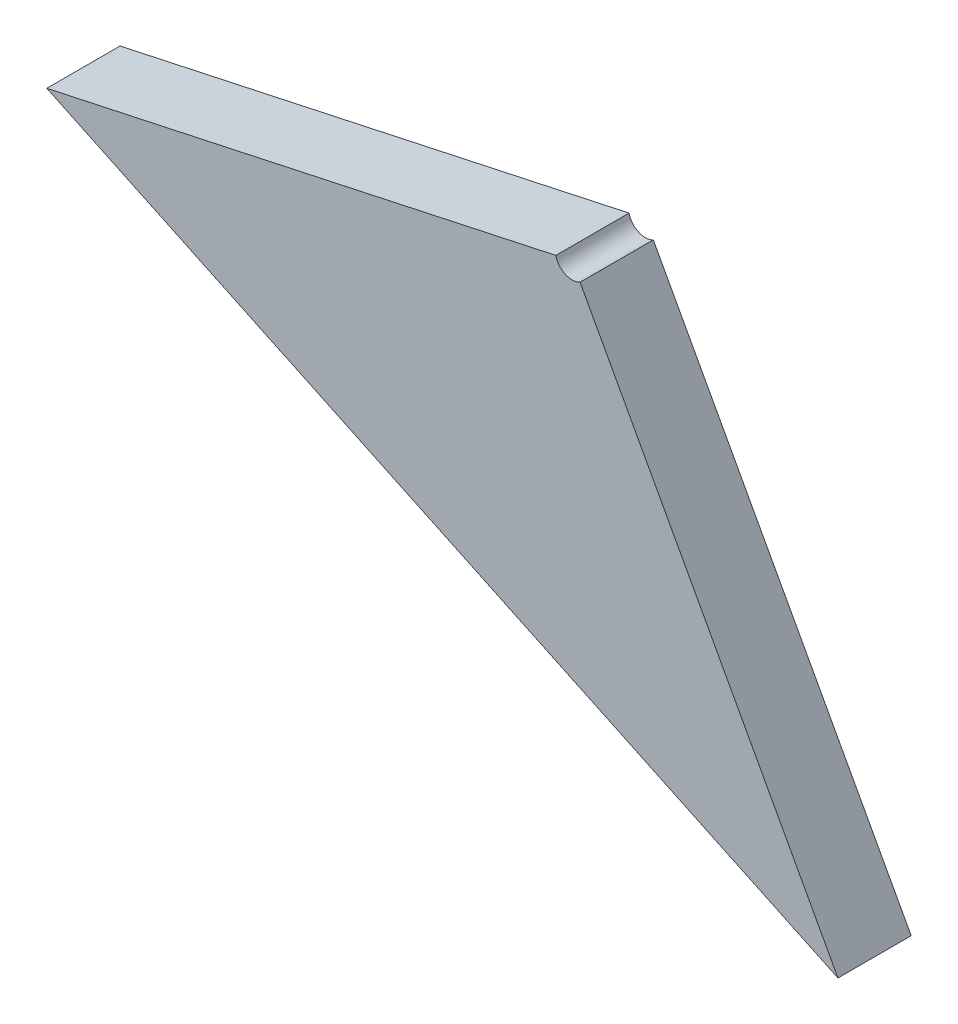
ISO-10303-21;
HEADER;
FILE_DESCRIPTION(('STEP AP214'),'2;1');
FILE_NAME('part.step','',(''),(''),'','','');
FILE_SCHEMA(('AUTOMOTIVE_DESIGN { 1 0 10303 214 1 1 1 1 }'));
ENDSEC;
DATA;
#1=APPLICATION_CONTEXT('core data for automotive mechanical design processes');
#2=APPLICATION_PROTOCOL_DEFINITION('international standard','automotive_design',2000,#1);
#3=PRODUCT_CONTEXT('',#1,'mechanical');
#4=PRODUCT('Part','Part','',(#3));
#5=PRODUCT_RELATED_PRODUCT_CATEGORY('part','',(#4));
#6=PRODUCT_DEFINITION_FORMATION('','',#4);
#7=PRODUCT_DEFINITION_CONTEXT('part definition',#1,'design');
#8=PRODUCT_DEFINITION('design','',#6,#7);
#9=PRODUCT_DEFINITION_SHAPE('','',#8);
#10=(LENGTH_UNIT() NAMED_UNIT(*) SI_UNIT(.MILLI.,.METRE.));
#11=(NAMED_UNIT(*) PLANE_ANGLE_UNIT() SI_UNIT($,.RADIAN.));
#12=(NAMED_UNIT(*) SI_UNIT($,.STERADIAN.) SOLID_ANGLE_UNIT());
#13=UNCERTAINTY_MEASURE_WITH_UNIT(LENGTH_MEASURE(1.E-05),#10,'distance_accuracy_value','');
#14=(GEOMETRIC_REPRESENTATION_CONTEXT(3) GLOBAL_UNCERTAINTY_ASSIGNED_CONTEXT((#13)) GLOBAL_UNIT_ASSIGNED_CONTEXT((#10,
#11,#12)) REPRESENTATION_CONTEXT('',''));
#15=CARTESIAN_POINT('',(0.,0.,0.));
#16=DIRECTION('',(0.,0.,1.));
#17=DIRECTION('',(1.,0.,0.));
#18=AXIS2_PLACEMENT_3D('',#15,#16,#17);
#19=CARTESIAN_POINT('',(-1.3105955580116,-1.3649345552813,0.00415));
#20=DIRECTION('',(0.,0.,1.));
#21=DIRECTION('',(1.,0.,0.));
#22=AXIS2_PLACEMENT_3D('',#19,#20,#21);
#23=PLANE('',#22);
#24=DIRECTION('',(0.903806397975915,-0.427941578930819,0.));
#25=VECTOR('',#24,1.);
#26=CARTESIAN_POINT('',(-1.3300665921287,-1.3604316847872,0.00415));
#27=LINE('',#26,#25);
#28=CARTESIAN_POINT('',(-1.3300126995183,-1.359965635438,0.00415));
#29=VERTEX_POINT('',#28);
#30=CARTESIAN_POINT('',(-1.2943644926877,-1.3768596313854,0.00415));
#31=VERTEX_POINT('',#30);
#32=EDGE_CURVE('E10',#29,#31,#27,.T.);
#33=ORIENTED_EDGE('',*,*,#32,.T.);
#34=DIRECTION('',(-0.47858839478236,0.878039377465296,0.));
#35=VECTOR('',#34,1.);
#36=CARTESIAN_POINT('',(-1.2943566582965,-1.3768513385986,0.00415));
#37=LINE('',#36,#35);
#38=CARTESIAN_POINT('',(-1.305984549447,-1.3555182966396,0.00415));
#39=VERTEX_POINT('',#38);
#40=EDGE_CURVE('E23',#31,#39,#37,.T.);
#41=ORIENTED_EDGE('',*,*,#40,.T.);
#42=CARTESIAN_POINT('',(-1.3063434907431,-1.3548597671065,0.00415));
#43=DIRECTION('',(0.,0.,-1.));
#44=DIRECTION('',(0.977619939969163,0.210378832049926,0.));
#45=AXIS2_PLACEMENT_3D('',#42,#43,#44);
#46=CIRCLE('',#45,0.000750000000000001);
#47=CARTESIAN_POINT('',(-1.307076705698,-1.3550175512306,0.00415));
#48=VERTEX_POINT('',#47);
#49=EDGE_CURVE('E136',#39,#48,#46,.T.);
#50=ORIENTED_EDGE('',*,*,#49,.T.);
#51=DIRECTION('',(-0.977619939969144,-0.210378832050014,0.));
#52=VECTOR('',#51,1.);
#53=CARTESIAN_POINT('',(-1.307076705698,-1.3550175512306,0.00415));
#54=LINE('',#53,#52);
#55=EDGE_CURVE('E137',#48,#29,#54,.T.);
#56=ORIENTED_EDGE('',*,*,#55,.T.);
#57=EDGE_LOOP('',(#33,#41,#50,#56));
#58=FACE_BOUND('',#57,.T.);
#59=ADVANCED_FACE('F16',(#58),#23,.T.);
#60=CARTESIAN_POINT('',(-1.3063434907431,-1.3548597671065,0.00115));
#61=DIRECTION('',(0.,0.,1.));
#62=DIRECTION('',(-1.,0.,0.));
#63=AXIS2_PLACEMENT_3D('',#60,#61,#62);
#64=CYLINDRICAL_SURFACE('',#63,0.00075);
#65=DIRECTION('',(0.,0.,1.));
#66=VECTOR('',#65,1.);
#67=CARTESIAN_POINT('',(-1.305984549447,-1.3555182966396,0.00115));
#68=LINE('',#67,#66);
#69=CARTESIAN_POINT('',(-1.305984549447,-1.3555182966396,0.00085));
#70=VERTEX_POINT('',#69);
#71=EDGE_CURVE('E134',#70,#39,#68,.T.);
#72=ORIENTED_EDGE('',*,*,#71,.F.);
#73=CARTESIAN_POINT('',(-1.3063434907431,-1.3548597671065,0.00085));
#74=DIRECTION('',(0.,0.,1.));
#75=DIRECTION('',(-1.,0.,0.));
#76=AXIS2_PLACEMENT_3D('',#73,#74,#75);
#77=CIRCLE('',#76,0.00075);
#78=CARTESIAN_POINT('',(-1.307076705698,-1.3550175512306,0.00085));
#79=VERTEX_POINT('',#78);
#80=EDGE_CURVE('E135',#79,#70,#77,.T.);
#81=ORIENTED_EDGE('',*,*,#80,.F.);
#82=DIRECTION('',(0.,0.,-1.));
#83=VECTOR('',#82,1.);
#84=CARTESIAN_POINT('',(-1.307076705698,-1.3550175512306,0.00115));
#85=LINE('',#84,#83);
#86=EDGE_CURVE('E73',#48,#79,#85,.T.);
#87=ORIENTED_EDGE('',*,*,#86,.F.);
#88=ORIENTED_EDGE('',*,*,#49,.F.);
#89=EDGE_LOOP('',(#72,#81,#87,#88));
#90=FACE_BOUND('',#89,.T.);
#91=ADVANCED_FACE('F92',(#90),#64,.F.);
#92=CARTESIAN_POINT('',(-1.3307444469272,-1.360110728603,0.00085));
#93=DIRECTION('',(-0.427941578930813,-0.903806397975918,0.));
#94=DIRECTION('',(0.903806397975918,-0.427941578930813,0.));
#95=AXIS2_PLACEMENT_3D('',#92,#93,#94);
#96=PLANE('',#95);
#97=CARTESIAN_POINT('',(-1.29435665829649,-1.3768513385986,0.00415));
#98=DIRECTION('',(0.,0.,-1.));
#99=VECTOR('',#98,1.);
#100=LINE('',#97,#99);
#101=CARTESIAN_POINT('',(-1.2943644926877,-1.3768596313854,0.00085));
#102=VERTEX_POINT('',#101);
#103=EDGE_CURVE('E61',#31,#102,#100,.T.);
#104=ORIENTED_EDGE('',*,*,#103,.F.);
#105=ORIENTED_EDGE('',*,*,#32,.F.);
#106=CARTESIAN_POINT('',(-1.33001123197222,-1.35995294447889,0.00085));
#107=DIRECTION('',(0.,0.,1.));
#108=VECTOR('',#107,1.);
#109=LINE('',#106,#108);
#110=CARTESIAN_POINT('',(-1.3300126995183,-1.359965635438,0.00085));
#111=VERTEX_POINT('',#110);
#112=EDGE_CURVE('E51',#111,#29,#109,.T.);
#113=ORIENTED_EDGE('',*,*,#112,.F.);
#114=DIRECTION('',(0.903806397975917,-0.427941578930813,0.));
#115=VECTOR('',#114,1.);
#116=CARTESIAN_POINT('',(-1.3307444469272,-1.360110728603,0.00085));
#117=LINE('',#116,#115);
#118=EDGE_CURVE('E55',#111,#102,#117,.T.);
#119=ORIENTED_EDGE('',*,*,#118,.T.);
#120=EDGE_LOOP('',(#104,#105,#113,#119));
#121=FACE_BOUND('',#120,.T.);
#122=ADVANCED_FACE('F54',(#121),#96,.T.);
#123=CARTESIAN_POINT('',(-1.3063434907431,-1.3548597671065,0.00085));
#124=DIRECTION('',(-0.210378832050013,0.977619939969144,0.));
#125=DIRECTION('',(-0.977619939969144,-0.210378832050013,0.));
#126=AXIS2_PLACEMENT_3D('',#123,#124,#125);
#127=PLANE('',#126);
#128=ORIENTED_EDGE('',*,*,#86,.T.);
#129=DIRECTION('',(-0.977619939969144,-0.210378832050013,0.));
#130=VECTOR('',#129,1.);
#131=CARTESIAN_POINT('',(-1.3063434907431,-1.3548597671065,0.00085));
#132=LINE('',#131,#130);
#133=EDGE_CURVE('E67',#79,#111,#132,.T.);
#134=ORIENTED_EDGE('',*,*,#133,.T.);
#135=ORIENTED_EDGE('',*,*,#112,.T.);
#136=ORIENTED_EDGE('',*,*,#55,.F.);
#137=EDGE_LOOP('',(#128,#134,#135,#136));
#138=FACE_BOUND('',#137,.T.);
#139=ADVANCED_FACE('F71',(#138),#127,.T.);
#140=CARTESIAN_POINT('',(-1.2939977170004,-1.3775098681317,0.00085));
#141=DIRECTION('',(0.878039377465294,0.478588394782364,0.));
#142=DIRECTION('',(-0.478588394782364,0.878039377465294,0.));
#143=AXIS2_PLACEMENT_3D('',#140,#141,#142);
#144=PLANE('',#143);
#145=ORIENTED_EDGE('',*,*,#103,.T.);
#146=DIRECTION('',(-0.478588394782364,0.878039377465294,0.));
#147=VECTOR('',#146,1.);
#148=CARTESIAN_POINT('',(-1.2939977170004,-1.3775098681317,0.00085));
#149=LINE('',#148,#147);
#150=EDGE_CURVE('E69',#102,#70,#149,.T.);
#151=ORIENTED_EDGE('',*,*,#150,.T.);
#152=ORIENTED_EDGE('',*,*,#71,.T.);
#153=ORIENTED_EDGE('',*,*,#40,.F.);
#154=EDGE_LOOP('',(#145,#151,#152,#153));
#155=FACE_BOUND('',#154,.T.);
#156=ADVANCED_FACE('F110',(#155),#144,.T.);
#157=CARTESIAN_POINT('',(-1.3106136419657,-1.3649772146385,0.00085));
#158=DIRECTION('',(0.,0.,1.));
#159=DIRECTION('',(1.,0.,0.));
#160=AXIS2_PLACEMENT_3D('',#157,#158,#159);
#161=PLANE('',#160);
#162=ORIENTED_EDGE('',*,*,#133,.F.);
#163=ORIENTED_EDGE('',*,*,#80,.T.);
#164=ORIENTED_EDGE('',*,*,#150,.F.);
#165=ORIENTED_EDGE('',*,*,#118,.F.);
#166=EDGE_LOOP('',(#162,#163,#164,#165));
#167=FACE_BOUND('',#166,.T.);
#168=ADVANCED_FACE('F66',(#167),#161,.F.);
#169=CLOSED_SHELL('',(#59,#91,#122,#139,#156,#168));
#170=MANIFOLD_SOLID_BREP('B1',#169);
#171=ADVANCED_BREP_SHAPE_REPRESENTATION('',(#18,#170),#14);
#172=SHAPE_DEFINITION_REPRESENTATION(#9,#171);
ENDSEC;
END-ISO-10303-21;
